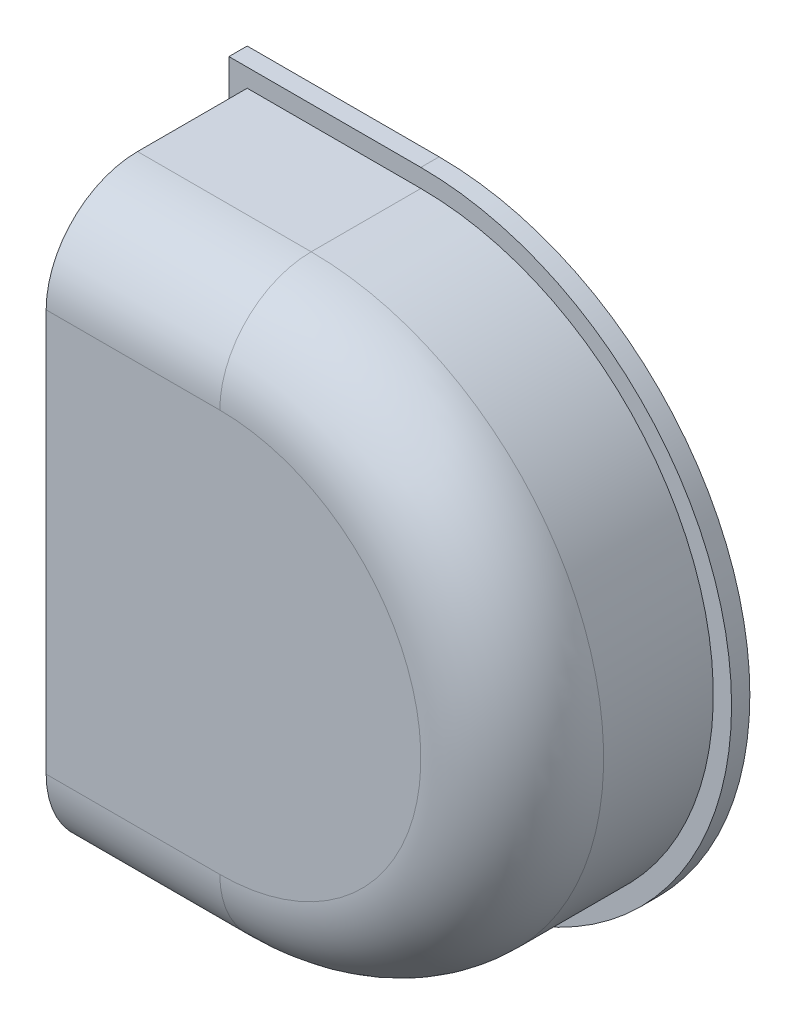
ISO-10303-21;
HEADER;
FILE_DESCRIPTION(('STEP AP214'),'2;1');
FILE_NAME('part.step','',(''),(''),'','','');
FILE_SCHEMA(('AUTOMOTIVE_DESIGN { 1 0 10303 214 1 1 1 1 }'));
ENDSEC;
DATA;
#1=APPLICATION_CONTEXT('core data for automotive mechanical design processes');
#2=APPLICATION_PROTOCOL_DEFINITION('international standard','automotive_design',2000,#1);
#3=PRODUCT_CONTEXT('',#1,'mechanical');
#4=PRODUCT('Part','Part','',(#3));
#5=PRODUCT_RELATED_PRODUCT_CATEGORY('part','',(#4));
#6=PRODUCT_DEFINITION_FORMATION('','',#4);
#7=PRODUCT_DEFINITION_CONTEXT('part definition',#1,'design');
#8=PRODUCT_DEFINITION('design','',#6,#7);
#9=PRODUCT_DEFINITION_SHAPE('','',#8);
#10=(LENGTH_UNIT() NAMED_UNIT(*) SI_UNIT(.MILLI.,.METRE.));
#11=(NAMED_UNIT(*) PLANE_ANGLE_UNIT() SI_UNIT($,.RADIAN.));
#12=(NAMED_UNIT(*) SI_UNIT($,.STERADIAN.) SOLID_ANGLE_UNIT());
#13=UNCERTAINTY_MEASURE_WITH_UNIT(LENGTH_MEASURE(1.E-05),#10,'distance_accuracy_value','');
#14=(GEOMETRIC_REPRESENTATION_CONTEXT(3) GLOBAL_UNCERTAINTY_ASSIGNED_CONTEXT((#13)) GLOBAL_UNIT_ASSIGNED_CONTEXT((#10,
#11,#12)) REPRESENTATION_CONTEXT('',''));
#15=CARTESIAN_POINT('',(0.,0.,0.));
#16=DIRECTION('',(0.,0.,1.));
#17=DIRECTION('',(1.,0.,0.));
#18=AXIS2_PLACEMENT_3D('',#15,#16,#17);
#19=CARTESIAN_POINT('',(19.,0.,22.));
#20=DIRECTION('',(0.,1.,0.));
#21=DIRECTION('',(0.,0.,1.));
#22=AXIS2_PLACEMENT_3D('',#19,#20,#21);
#23=PLANE('',#22);
#24=DIRECTION('',(0.,0.,-1.));
#25=VECTOR('',#24,1.);
#26=CARTESIAN_POINT('',(19.,0.,22.));
#27=LINE('',#26,#25);
#28=CARTESIAN_POINT('',(19.,0.,12.));
#29=VERTEX_POINT('',#28);
#30=CARTESIAN_POINT('',(19.,0.,0.));
#31=VERTEX_POINT('',#30);
#32=EDGE_CURVE('E264',#29,#31,#27,.T.);
#33=ORIENTED_EDGE('',*,*,#32,.F.);
#34=DIRECTION('',(1.,0.,0.));
#35=VECTOR('',#34,1.);
#36=CARTESIAN_POINT('',(19.,0.,12.));
#37=LINE('',#36,#35);
#38=CARTESIAN_POINT('',(0.,0.,12.));
#39=VERTEX_POINT('',#38);
#40=EDGE_CURVE('E274',#29,#39,#37,.F.);
#41=ORIENTED_EDGE('',*,*,#40,.T.);
#42=DIRECTION('',(0.,0.,-1.));
#43=VECTOR('',#42,1.);
#44=CARTESIAN_POINT('',(0.,0.,22.));
#45=LINE('',#44,#43);
#46=CARTESIAN_POINT('',(0.,0.,0.));
#47=VERTEX_POINT('',#46);
#48=EDGE_CURVE('E245',#39,#47,#45,.T.);
#49=ORIENTED_EDGE('',*,*,#48,.T.);
#50=DIRECTION('',(1.,0.,0.));
#51=VECTOR('',#50,1.);
#52=CARTESIAN_POINT('',(19.,0.,0.));
#53=LINE('',#52,#51);
#54=EDGE_CURVE('E247',#47,#31,#53,.T.);
#55=ORIENTED_EDGE('',*,*,#54,.T.);
#56=EDGE_LOOP('',(#33,#41,#49,#55));
#57=FACE_BOUND('',#56,.T.);
#58=ADVANCED_FACE('F35',(#57),#23,.F.);
#59=CARTESIAN_POINT('',(19.,32.,22.));
#60=DIRECTION('',(0.,0.,-1.));
#61=DIRECTION('',(-1.,0.,0.));
#62=AXIS2_PLACEMENT_3D('',#59,#60,#61);
#63=CYLINDRICAL_SURFACE('',#62,32.);
#64=DIRECTION('',(0.,0.,-1.));
#65=VECTOR('',#64,1.);
#66=CARTESIAN_POINT('',(19.,64.,22.));
#67=LINE('',#66,#65);
#68=CARTESIAN_POINT('',(19.,64.,12.));
#69=VERTEX_POINT('',#68);
#70=CARTESIAN_POINT('',(19.,64.,0.));
#71=VERTEX_POINT('',#70);
#72=EDGE_CURVE('E262',#69,#71,#67,.T.);
#73=ORIENTED_EDGE('',*,*,#72,.F.);
#74=CARTESIAN_POINT('',(19.,32.,12.));
#75=DIRECTION('',(0.,0.,-1.));
#76=DIRECTION('',(-1.,0.,0.));
#77=AXIS2_PLACEMENT_3D('',#74,#75,#76);
#78=CIRCLE('',#77,32.);
#79=EDGE_CURVE('E44',#69,#29,#78,.T.);
#80=ORIENTED_EDGE('',*,*,#79,.T.);
#81=ORIENTED_EDGE('',*,*,#32,.T.);
#82=CARTESIAN_POINT('',(19.,32.,0.));
#83=DIRECTION('',(0.,0.,1.));
#84=DIRECTION('',(-1.,0.,0.));
#85=AXIS2_PLACEMENT_3D('',#82,#83,#84);
#86=CIRCLE('',#85,32.);
#87=EDGE_CURVE('E250',#31,#71,#86,.T.);
#88=ORIENTED_EDGE('',*,*,#87,.T.);
#89=EDGE_LOOP('',(#73,#80,#81,#88));
#90=FACE_BOUND('',#89,.T.);
#91=ADVANCED_FACE('F300',(#90),#63,.T.);
#92=CARTESIAN_POINT('',(0.,64.,22.));
#93=DIRECTION('',(0.,-1.,0.));
#94=DIRECTION('',(0.,0.,-1.));
#95=AXIS2_PLACEMENT_3D('',#92,#93,#94);
#96=PLANE('',#95);
#97=DIRECTION('',(0.,0.,-1.));
#98=VECTOR('',#97,1.);
#99=CARTESIAN_POINT('',(0.,64.,22.));
#100=LINE('',#99,#98);
#101=CARTESIAN_POINT('',(0.,64.,12.));
#102=VERTEX_POINT('',#101);
#103=CARTESIAN_POINT('',(0.,64.,0.));
#104=VERTEX_POINT('',#103);
#105=EDGE_CURVE('E260',#102,#104,#100,.T.);
#106=ORIENTED_EDGE('',*,*,#105,.F.);
#107=DIRECTION('',(-1.,0.,0.));
#108=VECTOR('',#107,1.);
#109=CARTESIAN_POINT('',(0.,64.,12.));
#110=LINE('',#109,#108);
#111=EDGE_CURVE('E12',#102,#69,#110,.F.);
#112=ORIENTED_EDGE('',*,*,#111,.T.);
#113=ORIENTED_EDGE('',*,*,#72,.T.);
#114=DIRECTION('',(-1.,0.,0.));
#115=VECTOR('',#114,1.);
#116=CARTESIAN_POINT('',(0.,64.,0.));
#117=LINE('',#116,#115);
#118=EDGE_CURVE('E253',#71,#104,#117,.T.);
#119=ORIENTED_EDGE('',*,*,#118,.T.);
#120=EDGE_LOOP('',(#106,#112,#113,#119));
#121=FACE_BOUND('',#120,.T.);
#122=ADVANCED_FACE('F301',(#121),#96,.F.);
#123=CARTESIAN_POINT('',(0.,0.,22.));
#124=DIRECTION('',(1.,0.,0.));
#125=DIRECTION('',(0.,0.,-1.));
#126=AXIS2_PLACEMENT_3D('',#123,#124,#125);
#127=PLANE('',#126);
#128=ORIENTED_EDGE('',*,*,#48,.F.);
#129=CARTESIAN_POINT('',(0.,10.,12.));
#130=DIRECTION('',(1.,0.,0.));
#131=DIRECTION('',(0.,0.,-1.));
#132=AXIS2_PLACEMENT_3D('',#129,#130,#131);
#133=CIRCLE('',#132,10.);
#134=CARTESIAN_POINT('',(0.,10.,22.));
#135=VERTEX_POINT('',#134);
#136=EDGE_CURVE('E277',#39,#135,#133,.F.);
#137=ORIENTED_EDGE('',*,*,#136,.T.);
#138=DIRECTION('',(0.,-1.,0.));
#139=VECTOR('',#138,1.);
#140=CARTESIAN_POINT('',(0.,0.,22.));
#141=LINE('',#140,#139);
#142=CARTESIAN_POINT('',(0.,54.,22.));
#143=VERTEX_POINT('',#142);
#144=EDGE_CURVE('E242',#143,#135,#141,.T.);
#145=ORIENTED_EDGE('',*,*,#144,.F.);
#146=CARTESIAN_POINT('',(0.,54.,12.));
#147=DIRECTION('',(1.,0.,0.));
#148=DIRECTION('',(0.,0.,-1.));
#149=AXIS2_PLACEMENT_3D('',#146,#147,#148);
#150=CIRCLE('',#149,10.);
#151=EDGE_CURVE('E58',#143,#102,#150,.F.);
#152=ORIENTED_EDGE('',*,*,#151,.T.);
#153=ORIENTED_EDGE('',*,*,#105,.T.);
#154=DIRECTION('',(0.,-1.,0.));
#155=VECTOR('',#154,1.);
#156=CARTESIAN_POINT('',(0.,0.,0.));
#157=LINE('',#156,#155);
#158=EDGE_CURVE('E246',#104,#47,#157,.T.);
#159=ORIENTED_EDGE('',*,*,#158,.T.);
#160=EDGE_LOOP('',(#128,#137,#145,#152,#153,#159));
#161=FACE_BOUND('',#160,.T.);
#162=ADVANCED_FACE('F294',(#161),#127,.F.);
#163=CARTESIAN_POINT('',(19.,32.,22.));
#164=DIRECTION('',(0.,0.,-1.));
#165=DIRECTION('',(-1.,0.,0.));
#166=AXIS2_PLACEMENT_3D('',#163,#164,#165);
#167=PLANE('',#166);
#168=ORIENTED_EDGE('',*,*,#144,.T.);
#169=DIRECTION('',(1.,0.,0.));
#170=VECTOR('',#169,1.);
#171=CARTESIAN_POINT('',(19.,10.,22.));
#172=LINE('',#171,#170);
#173=CARTESIAN_POINT('',(19.,10.,22.));
#174=VERTEX_POINT('',#173);
#175=EDGE_CURVE('E271',#135,#174,#172,.T.);
#176=ORIENTED_EDGE('',*,*,#175,.T.);
#177=CARTESIAN_POINT('',(19.,32.,22.));
#178=DIRECTION('',(0.,0.,-1.));
#179=DIRECTION('',(-1.,0.,0.));
#180=AXIS2_PLACEMENT_3D('',#177,#178,#179);
#181=CIRCLE('',#180,22.);
#182=CARTESIAN_POINT('',(19.,54.,22.));
#183=VERTEX_POINT('',#182);
#184=EDGE_CURVE('E269',#174,#183,#181,.F.);
#185=ORIENTED_EDGE('',*,*,#184,.T.);
#186=DIRECTION('',(-1.,0.,0.));
#187=VECTOR('',#186,1.);
#188=CARTESIAN_POINT('',(19.,54.,22.));
#189=LINE('',#188,#187);
#190=EDGE_CURVE('E267',#183,#143,#189,.T.);
#191=ORIENTED_EDGE('',*,*,#190,.T.);
#192=EDGE_LOOP('',(#168,#176,#185,#191));
#193=FACE_BOUND('',#192,.T.);
#194=ADVANCED_FACE('F292',(#193),#167,.F.);
#195=CARTESIAN_POINT('',(19.,54.,12.));
#196=DIRECTION('',(-1.,0.,0.));
#197=DIRECTION('',(0.,0.,1.));
#198=AXIS2_PLACEMENT_3D('',#195,#196,#197);
#199=CYLINDRICAL_SURFACE('',#198,10.);
#200=ORIENTED_EDGE('',*,*,#151,.F.);
#201=ORIENTED_EDGE('',*,*,#190,.F.);
#202=CARTESIAN_POINT('',(19.,54.,12.));
#203=DIRECTION('',(1.,0.,0.));
#204=DIRECTION('',(0.,0.,-1.));
#205=AXIS2_PLACEMENT_3D('',#202,#203,#204);
#206=CIRCLE('',#205,10.);
#207=EDGE_CURVE('E39',#69,#183,#206,.T.);
#208=ORIENTED_EDGE('',*,*,#207,.F.);
#209=ORIENTED_EDGE('',*,*,#111,.F.);
#210=EDGE_LOOP('',(#200,#201,#208,#209));
#211=FACE_BOUND('',#210,.T.);
#212=ADVANCED_FACE('F37',(#211),#199,.T.);
#213=CARTESIAN_POINT('',(19.,32.,12.));
#214=DIRECTION('',(0.,0.,-1.));
#215=DIRECTION('',(-1.,0.,0.));
#216=AXIS2_PLACEMENT_3D('',#213,#214,#215);
#217=TOROIDAL_SURFACE('',#216,22.,10.);
#218=ORIENTED_EDGE('',*,*,#207,.T.);
#219=ORIENTED_EDGE('',*,*,#184,.F.);
#220=CARTESIAN_POINT('',(19.,10.,12.));
#221=DIRECTION('',(-1.,0.,0.));
#222=DIRECTION('',(0.,0.,1.));
#223=AXIS2_PLACEMENT_3D('',#220,#221,#222);
#224=CIRCLE('',#223,10.);
#225=EDGE_CURVE('E229',#29,#174,#224,.T.);
#226=ORIENTED_EDGE('',*,*,#225,.F.);
#227=ORIENTED_EDGE('',*,*,#79,.F.);
#228=EDGE_LOOP('',(#218,#219,#226,#227));
#229=FACE_BOUND('',#228,.T.);
#230=ADVANCED_FACE('F288',(#229),#217,.T.);
#231=CARTESIAN_POINT('',(19.,10.,12.));
#232=DIRECTION('',(1.,0.,0.));
#233=DIRECTION('',(0.,0.,-1.));
#234=AXIS2_PLACEMENT_3D('',#231,#232,#233);
#235=CYLINDRICAL_SURFACE('',#234,10.);
#236=ORIENTED_EDGE('',*,*,#136,.F.);
#237=ORIENTED_EDGE('',*,*,#40,.F.);
#238=ORIENTED_EDGE('',*,*,#225,.T.);
#239=ORIENTED_EDGE('',*,*,#175,.F.);
#240=EDGE_LOOP('',(#236,#237,#238,#239));
#241=FACE_BOUND('',#240,.T.);
#242=ADVANCED_FACE('F296',(#241),#235,.T.);
#243=CARTESIAN_POINT('',(19.,32.,0.));
#244=DIRECTION('',(0.,0.,-1.));
#245=DIRECTION('',(-1.,0.,0.));
#246=AXIS2_PLACEMENT_3D('',#243,#244,#245);
#247=PLANE('',#246);
#248=DIRECTION('',(-1.,0.,0.));
#249=VECTOR('',#248,1.);
#250=CARTESIAN_POINT('',(19.,-2.,0.));
#251=LINE('',#250,#249);
#252=CARTESIAN_POINT('',(19.,-2.,0.));
#253=VERTEX_POINT('',#252);
#254=CARTESIAN_POINT('',(-2.,-2.,0.));
#255=VERTEX_POINT('',#254);
#256=EDGE_CURVE('E185',#253,#255,#251,.T.);
#257=ORIENTED_EDGE('',*,*,#256,.F.);
#258=CARTESIAN_POINT('',(19.,32.,0.));
#259=DIRECTION('',(0.,0.,-1.));
#260=DIRECTION('',(-1.,0.,0.));
#261=AXIS2_PLACEMENT_3D('',#258,#259,#260);
#262=CIRCLE('',#261,34.);
#263=CARTESIAN_POINT('',(19.,66.,0.));
#264=VERTEX_POINT('',#263);
#265=EDGE_CURVE('E190',#264,#253,#262,.T.);
#266=ORIENTED_EDGE('',*,*,#265,.F.);
#267=DIRECTION('',(1.,0.,0.));
#268=VECTOR('',#267,1.);
#269=CARTESIAN_POINT('',(-2.,66.,0.));
#270=LINE('',#269,#268);
#271=CARTESIAN_POINT('',(-2.,66.,0.));
#272=VERTEX_POINT('',#271);
#273=EDGE_CURVE('E201',#272,#264,#270,.T.);
#274=ORIENTED_EDGE('',*,*,#273,.F.);
#275=DIRECTION('',(0.,1.,0.));
#276=VECTOR('',#275,1.);
#277=CARTESIAN_POINT('',(-2.,-2.,0.));
#278=LINE('',#277,#276);
#279=EDGE_CURVE('E199',#255,#272,#278,.T.);
#280=ORIENTED_EDGE('',*,*,#279,.F.);
#281=EDGE_LOOP('',(#257,#266,#274,#280));
#282=FACE_BOUND('',#281,.T.);
#283=ORIENTED_EDGE('',*,*,#87,.F.);
#284=ORIENTED_EDGE('',*,*,#54,.F.);
#285=ORIENTED_EDGE('',*,*,#158,.F.);
#286=ORIENTED_EDGE('',*,*,#118,.F.);
#287=EDGE_LOOP('',(#283,#284,#285,#286));
#288=FACE_BOUND('',#287,.T.);
#289=ADVANCED_FACE('F303',(#282,#288),#247,.F.);
#290=CARTESIAN_POINT('',(19.,32.,-2.));
#291=DIRECTION('',(0.,0.,-1.));
#292=DIRECTION('',(-1.,0.,0.));
#293=AXIS2_PLACEMENT_3D('',#290,#291,#292);
#294=PLANE('',#293);
#295=DIRECTION('',(-1.,0.,0.));
#296=VECTOR('',#295,1.);
#297=CARTESIAN_POINT('',(19.,-2.,-2.));
#298=LINE('',#297,#296);
#299=CARTESIAN_POINT('',(19.,-2.,-2.));
#300=VERTEX_POINT('',#299);
#301=CARTESIAN_POINT('',(-2.,-2.,-2.));
#302=VERTEX_POINT('',#301);
#303=EDGE_CURVE('E186',#300,#302,#298,.T.);
#304=ORIENTED_EDGE('',*,*,#303,.T.);
#305=DIRECTION('',(0.,1.,0.));
#306=VECTOR('',#305,1.);
#307=CARTESIAN_POINT('',(-2.,-2.,-2.));
#308=LINE('',#307,#306);
#309=CARTESIAN_POINT('',(-2.,66.,-2.));
#310=VERTEX_POINT('',#309);
#311=EDGE_CURVE('E189',#302,#310,#308,.T.);
#312=ORIENTED_EDGE('',*,*,#311,.T.);
#313=DIRECTION('',(1.,0.,0.));
#314=VECTOR('',#313,1.);
#315=CARTESIAN_POINT('',(-2.,66.,-2.));
#316=LINE('',#315,#314);
#317=CARTESIAN_POINT('',(19.,66.,-2.));
#318=VERTEX_POINT('',#317);
#319=EDGE_CURVE('E192',#310,#318,#316,.T.);
#320=ORIENTED_EDGE('',*,*,#319,.T.);
#321=CARTESIAN_POINT('',(19.,32.,-2.));
#322=DIRECTION('',(0.,0.,-1.));
#323=DIRECTION('',(-1.,0.,0.));
#324=AXIS2_PLACEMENT_3D('',#321,#322,#323);
#325=CIRCLE('',#324,34.);
#326=EDGE_CURVE('E194',#318,#300,#325,.T.);
#327=ORIENTED_EDGE('',*,*,#326,.T.);
#328=EDGE_LOOP('',(#304,#312,#320,#327));
#329=FACE_BOUND('',#328,.T.);
#330=DIRECTION('',(0.,1.,0.));
#331=VECTOR('',#330,1.);
#332=CARTESIAN_POINT('',(3.,3.,-2.));
#333=LINE('',#332,#331);
#334=CARTESIAN_POINT('',(3.,3.,-2.));
#335=VERTEX_POINT('',#334);
#336=CARTESIAN_POINT('',(3.,61.,-2.));
#337=VERTEX_POINT('',#336);
#338=EDGE_CURVE('E157',#335,#337,#333,.T.);
#339=ORIENTED_EDGE('',*,*,#338,.F.);
#340=DIRECTION('',(-1.,0.,0.));
#341=VECTOR('',#340,1.);
#342=CARTESIAN_POINT('',(19.,3.,-2.));
#343=LINE('',#342,#341);
#344=CARTESIAN_POINT('',(19.,3.,-2.));
#345=VERTEX_POINT('',#344);
#346=EDGE_CURVE('E167',#345,#335,#343,.T.);
#347=ORIENTED_EDGE('',*,*,#346,.F.);
#348=CARTESIAN_POINT('',(19.,32.,-2.));
#349=DIRECTION('',(0.,0.,-1.));
#350=DIRECTION('',(-1.,0.,0.));
#351=AXIS2_PLACEMENT_3D('',#348,#349,#350);
#352=CIRCLE('',#351,29.);
#353=CARTESIAN_POINT('',(19.,61.,-2.));
#354=VERTEX_POINT('',#353);
#355=EDGE_CURVE('E180',#354,#345,#352,.T.);
#356=ORIENTED_EDGE('',*,*,#355,.F.);
#357=DIRECTION('',(1.,0.,0.));
#358=VECTOR('',#357,1.);
#359=CARTESIAN_POINT('',(3.,61.,-2.));
#360=LINE('',#359,#358);
#361=EDGE_CURVE('E178',#337,#354,#360,.T.);
#362=ORIENTED_EDGE('',*,*,#361,.F.);
#363=EDGE_LOOP('',(#339,#347,#356,#362));
#364=FACE_BOUND('',#363,.T.);
#365=ADVANCED_FACE('F176',(#329,#364),#294,.T.);
#366=CARTESIAN_POINT('',(19.,-2.,-2.));
#367=DIRECTION('',(0.,1.,0.));
#368=DIRECTION('',(-1.,0.,0.));
#369=AXIS2_PLACEMENT_3D('',#366,#367,#368);
#370=PLANE('',#369);
#371=ORIENTED_EDGE('',*,*,#256,.T.);
#372=DIRECTION('',(0.,0.,1.));
#373=VECTOR('',#372,1.);
#374=CARTESIAN_POINT('',(-2.,-2.,-2.));
#375=LINE('',#374,#373);
#376=EDGE_CURVE('E212',#302,#255,#375,.T.);
#377=ORIENTED_EDGE('',*,*,#376,.F.);
#378=ORIENTED_EDGE('',*,*,#303,.F.);
#379=DIRECTION('',(0.,0.,1.));
#380=VECTOR('',#379,1.);
#381=CARTESIAN_POINT('',(19.,-2.,-2.));
#382=LINE('',#381,#380);
#383=EDGE_CURVE('E196',#300,#253,#382,.T.);
#384=ORIENTED_EDGE('',*,*,#383,.T.);
#385=EDGE_LOOP('',(#371,#377,#378,#384));
#386=FACE_BOUND('',#385,.T.);
#387=ADVANCED_FACE('F311',(#386),#370,.F.);
#388=CARTESIAN_POINT('',(-2.,-2.,-2.));
#389=DIRECTION('',(1.,0.,0.));
#390=DIRECTION('',(0.,0.,-1.));
#391=AXIS2_PLACEMENT_3D('',#388,#389,#390);
#392=PLANE('',#391);
#393=ORIENTED_EDGE('',*,*,#279,.T.);
#394=DIRECTION('',(0.,0.,1.));
#395=VECTOR('',#394,1.);
#396=CARTESIAN_POINT('',(-2.,66.,-2.));
#397=LINE('',#396,#395);
#398=EDGE_CURVE('E209',#310,#272,#397,.T.);
#399=ORIENTED_EDGE('',*,*,#398,.F.);
#400=ORIENTED_EDGE('',*,*,#311,.F.);
#401=ORIENTED_EDGE('',*,*,#376,.T.);
#402=EDGE_LOOP('',(#393,#399,#400,#401));
#403=FACE_BOUND('',#402,.T.);
#404=ADVANCED_FACE('F369',(#403),#392,.F.);
#405=CARTESIAN_POINT('',(-2.,66.,-2.));
#406=DIRECTION('',(0.,-1.,0.));
#407=DIRECTION('',(0.,0.,-1.));
#408=AXIS2_PLACEMENT_3D('',#405,#406,#407);
#409=PLANE('',#408);
#410=ORIENTED_EDGE('',*,*,#273,.T.);
#411=DIRECTION('',(0.,0.,1.));
#412=VECTOR('',#411,1.);
#413=CARTESIAN_POINT('',(19.,66.,-2.));
#414=LINE('',#413,#412);
#415=EDGE_CURVE('E206',#318,#264,#414,.T.);
#416=ORIENTED_EDGE('',*,*,#415,.F.);
#417=ORIENTED_EDGE('',*,*,#319,.F.);
#418=ORIENTED_EDGE('',*,*,#398,.T.);
#419=EDGE_LOOP('',(#410,#416,#417,#418));
#420=FACE_BOUND('',#419,.T.);
#421=ADVANCED_FACE('F379',(#420),#409,.F.);
#422=CARTESIAN_POINT('',(19.,32.,-2.));
#423=DIRECTION('',(0.,0.,1.));
#424=DIRECTION('',(1.,0.,0.));
#425=AXIS2_PLACEMENT_3D('',#422,#423,#424);
#426=CYLINDRICAL_SURFACE('',#425,34.);
#427=ORIENTED_EDGE('',*,*,#265,.T.);
#428=ORIENTED_EDGE('',*,*,#383,.F.);
#429=ORIENTED_EDGE('',*,*,#326,.F.);
#430=ORIENTED_EDGE('',*,*,#415,.T.);
#431=EDGE_LOOP('',(#427,#428,#429,#430));
#432=FACE_BOUND('',#431,.T.);
#433=ADVANCED_FACE('F389',(#432),#426,.T.);
#434=CARTESIAN_POINT('',(19.,32.,12.));
#435=DIRECTION('',(0.,0.,-1.));
#436=DIRECTION('',(-1.,0.,0.));
#437=AXIS2_PLACEMENT_3D('',#434,#435,#436);
#438=TOROIDAL_SURFACE('',#437,22.,7.);
#439=CARTESIAN_POINT('',(19.,54.,12.));
#440=DIRECTION('',(-1.,0.,0.));
#441=DIRECTION('',(0.,-1.,0.));
#442=AXIS2_PLACEMENT_3D('',#439,#440,#441);
#443=CIRCLE('',#442,7.);
#444=CARTESIAN_POINT('',(19.,61.,12.));
#445=VERTEX_POINT('',#444);
#446=CARTESIAN_POINT('',(19.,54.,19.));
#447=VERTEX_POINT('',#446);
#448=EDGE_CURVE('E232',#445,#447,#443,.F.);
#449=ORIENTED_EDGE('',*,*,#448,.F.);
#450=CARTESIAN_POINT('',(19.,32.,12.));
#451=DIRECTION('',(0.,0.,-1.));
#452=DIRECTION('',(-1.,0.,0.));
#453=AXIS2_PLACEMENT_3D('',#450,#451,#452);
#454=CIRCLE('',#453,29.);
#455=CARTESIAN_POINT('',(19.,3.,12.));
#456=VERTEX_POINT('',#455);
#457=EDGE_CURVE('E224',#445,#456,#454,.T.);
#458=ORIENTED_EDGE('',*,*,#457,.T.);
#459=CARTESIAN_POINT('',(19.,10.,12.));
#460=DIRECTION('',(1.,0.,0.));
#461=DIRECTION('',(0.,0.,-1.));
#462=AXIS2_PLACEMENT_3D('',#459,#460,#461);
#463=CIRCLE('',#462,7.);
#464=CARTESIAN_POINT('',(19.,10.,19.));
#465=VERTEX_POINT('',#464);
#466=EDGE_CURVE('E215',#456,#465,#463,.F.);
#467=ORIENTED_EDGE('',*,*,#466,.T.);
#468=CARTESIAN_POINT('',(19.,32.,19.));
#469=DIRECTION('',(0.,0.,-1.));
#470=DIRECTION('',(-1.,0.,0.));
#471=AXIS2_PLACEMENT_3D('',#468,#469,#470);
#472=CIRCLE('',#471,22.);
#473=EDGE_CURVE('E236',#465,#447,#472,.F.);
#474=ORIENTED_EDGE('',*,*,#473,.T.);
#475=EDGE_LOOP('',(#449,#458,#467,#474));
#476=FACE_BOUND('',#475,.T.);
#477=ADVANCED_FACE('F399',(#476),#438,.F.);
#478=CARTESIAN_POINT('',(19.,10.,12.));
#479=DIRECTION('',(1.,0.,0.));
#480=DIRECTION('',(0.,0.,-1.));
#481=AXIS2_PLACEMENT_3D('',#478,#479,#480);
#482=CYLINDRICAL_SURFACE('',#481,7.);
#483=CARTESIAN_POINT('',(3.,10.,12.));
#484=DIRECTION('',(1.,0.,0.));
#485=DIRECTION('',(0.,0.,-1.));
#486=AXIS2_PLACEMENT_3D('',#483,#484,#485);
#487=CIRCLE('',#486,7.);
#488=CARTESIAN_POINT('',(3.,3.,12.));
#489=VERTEX_POINT('',#488);
#490=CARTESIAN_POINT('',(3.,10.,19.));
#491=VERTEX_POINT('',#490);
#492=EDGE_CURVE('E160',#489,#491,#487,.F.);
#493=ORIENTED_EDGE('',*,*,#492,.T.);
#494=DIRECTION('',(-1.,0.,0.));
#495=VECTOR('',#494,1.);
#496=CARTESIAN_POINT('',(19.,10.,19.));
#497=LINE('',#496,#495);
#498=EDGE_CURVE('E221',#491,#465,#497,.F.);
#499=ORIENTED_EDGE('',*,*,#498,.T.);
#500=ORIENTED_EDGE('',*,*,#466,.F.);
#501=DIRECTION('',(1.,0.,0.));
#502=VECTOR('',#501,1.);
#503=CARTESIAN_POINT('',(19.,3.,12.));
#504=LINE('',#503,#502);
#505=EDGE_CURVE('E219',#456,#489,#504,.F.);
#506=ORIENTED_EDGE('',*,*,#505,.T.);
#507=EDGE_LOOP('',(#493,#499,#500,#506));
#508=FACE_BOUND('',#507,.T.);
#509=ADVANCED_FACE('F337',(#508),#482,.F.);
#510=CARTESIAN_POINT('',(19.,32.,19.));
#511=DIRECTION('',(0.,0.,-1.));
#512=DIRECTION('',(-1.,0.,0.));
#513=AXIS2_PLACEMENT_3D('',#510,#511,#512);
#514=PLANE('',#513);
#515=CARTESIAN_POINT('',(18.9999999999999,32.,19.));
#516=DIRECTION('',(0.,0.,-1.));
#517=DIRECTION('',(-1.,0.,0.));
#518=AXIS2_PLACEMENT_3D('',#515,#516,#517);
#519=CIRCLE('',#518,5.);
#520=CARTESIAN_POINT('',(13.9999999999999,32.,19.));
#521=VERTEX_POINT('',#520);
#522=EDGE_CURVE('E481',#521,#521,#519,.T.);
#523=ORIENTED_EDGE('',*,*,#522,.F.);
#524=EDGE_LOOP('',(#523));
#525=FACE_BOUND('',#524,.T.);
#526=DIRECTION('',(0.,-1.,0.));
#527=VECTOR('',#526,1.);
#528=CARTESIAN_POINT('',(3.,32.,19.));
#529=LINE('',#528,#527);
#530=CARTESIAN_POINT('',(3.,54.,19.));
#531=VERTEX_POINT('',#530);
#532=EDGE_CURVE('E164',#531,#491,#529,.T.);
#533=ORIENTED_EDGE('',*,*,#532,.F.);
#534=DIRECTION('',(-1.,0.,0.));
#535=VECTOR('',#534,1.);
#536=CARTESIAN_POINT('',(19.,54.,19.));
#537=LINE('',#536,#535);
#538=EDGE_CURVE('E217',#447,#531,#537,.T.);
#539=ORIENTED_EDGE('',*,*,#538,.F.);
#540=ORIENTED_EDGE('',*,*,#473,.F.);
#541=ORIENTED_EDGE('',*,*,#498,.F.);
#542=EDGE_LOOP('',(#533,#539,#540,#541));
#543=FACE_BOUND('',#542,.T.);
#544=ADVANCED_FACE('F450',(#525,#543),#514,.T.);
#545=CARTESIAN_POINT('',(19.,54.,12.));
#546=DIRECTION('',(-1.,0.,0.));
#547=DIRECTION('',(0.,0.,1.));
#548=AXIS2_PLACEMENT_3D('',#545,#546,#547);
#549=CYLINDRICAL_SURFACE('',#548,7.);
#550=CARTESIAN_POINT('',(3.,54.,12.));
#551=DIRECTION('',(1.,0.,0.));
#552=DIRECTION('',(0.,0.,-1.));
#553=AXIS2_PLACEMENT_3D('',#550,#551,#552);
#554=CIRCLE('',#553,7.);
#555=CARTESIAN_POINT('',(3.,61.,12.));
#556=VERTEX_POINT('',#555);
#557=EDGE_CURVE('E220',#531,#556,#554,.F.);
#558=ORIENTED_EDGE('',*,*,#557,.T.);
#559=DIRECTION('',(1.,0.,0.));
#560=VECTOR('',#559,1.);
#561=CARTESIAN_POINT('',(0.,61.,12.));
#562=LINE('',#561,#560);
#563=EDGE_CURVE('E226',#556,#445,#562,.T.);
#564=ORIENTED_EDGE('',*,*,#563,.T.);
#565=ORIENTED_EDGE('',*,*,#448,.T.);
#566=ORIENTED_EDGE('',*,*,#538,.T.);
#567=EDGE_LOOP('',(#558,#564,#565,#566));
#568=FACE_BOUND('',#567,.T.);
#569=ADVANCED_FACE('F410',(#568),#549,.F.);
#570=CARTESIAN_POINT('',(3.,0.,22.));
#571=DIRECTION('',(1.,0.,0.));
#572=DIRECTION('',(0.,0.,-1.));
#573=AXIS2_PLACEMENT_3D('',#570,#571,#572);
#574=PLANE('',#573);
#575=DIRECTION('',(0.,0.,-1.));
#576=VECTOR('',#575,1.);
#577=CARTESIAN_POINT('',(3.,3.,22.));
#578=LINE('',#577,#576);
#579=EDGE_CURVE('E152',#489,#335,#578,.T.);
#580=ORIENTED_EDGE('',*,*,#579,.T.);
#581=ORIENTED_EDGE('',*,*,#338,.T.);
#582=DIRECTION('',(0.,0.,-1.));
#583=VECTOR('',#582,1.);
#584=CARTESIAN_POINT('',(3.,61.,22.));
#585=LINE('',#584,#583);
#586=EDGE_CURVE('E163',#556,#337,#585,.T.);
#587=ORIENTED_EDGE('',*,*,#586,.F.);
#588=ORIENTED_EDGE('',*,*,#557,.F.);
#589=ORIENTED_EDGE('',*,*,#532,.T.);
#590=ORIENTED_EDGE('',*,*,#492,.F.);
#591=EDGE_LOOP('',(#580,#581,#587,#588,#589,#590));
#592=FACE_BOUND('',#591,.T.);
#593=ADVANCED_FACE('F154',(#592),#574,.T.);
#594=CARTESIAN_POINT('',(0.,61.,22.));
#595=DIRECTION('',(0.,-1.,0.));
#596=DIRECTION('',(0.,0.,-1.));
#597=AXIS2_PLACEMENT_3D('',#594,#595,#596);
#598=PLANE('',#597);
#599=ORIENTED_EDGE('',*,*,#586,.T.);
#600=ORIENTED_EDGE('',*,*,#361,.T.);
#601=DIRECTION('',(0.,0.,-1.));
#602=VECTOR('',#601,1.);
#603=CARTESIAN_POINT('',(19.,61.,22.));
#604=LINE('',#603,#602);
#605=EDGE_CURVE('E218',#445,#354,#604,.T.);
#606=ORIENTED_EDGE('',*,*,#605,.F.);
#607=ORIENTED_EDGE('',*,*,#563,.F.);
#608=EDGE_LOOP('',(#599,#600,#606,#607));
#609=FACE_BOUND('',#608,.T.);
#610=ADVANCED_FACE('F409',(#609),#598,.T.);
#611=CARTESIAN_POINT('',(19.,32.,22.));
#612=DIRECTION('',(0.,0.,-1.));
#613=DIRECTION('',(-1.,0.,0.));
#614=AXIS2_PLACEMENT_3D('',#611,#612,#613);
#615=CYLINDRICAL_SURFACE('',#614,29.);
#616=ORIENTED_EDGE('',*,*,#605,.T.);
#617=ORIENTED_EDGE('',*,*,#355,.T.);
#618=DIRECTION('',(0.,0.,-1.));
#619=VECTOR('',#618,1.);
#620=CARTESIAN_POINT('',(19.,3.,22.));
#621=LINE('',#620,#619);
#622=EDGE_CURVE('E170',#456,#345,#621,.T.);
#623=ORIENTED_EDGE('',*,*,#622,.F.);
#624=ORIENTED_EDGE('',*,*,#457,.F.);
#625=EDGE_LOOP('',(#616,#617,#623,#624));
#626=FACE_BOUND('',#625,.T.);
#627=ADVANCED_FACE('F421',(#626),#615,.F.);
#628=CARTESIAN_POINT('',(19.,3.,22.));
#629=DIRECTION('',(0.,1.,0.));
#630=DIRECTION('',(0.,0.,1.));
#631=AXIS2_PLACEMENT_3D('',#628,#629,#630);
#632=PLANE('',#631);
#633=ORIENTED_EDGE('',*,*,#622,.T.);
#634=ORIENTED_EDGE('',*,*,#346,.T.);
#635=ORIENTED_EDGE('',*,*,#579,.F.);
#636=ORIENTED_EDGE('',*,*,#505,.F.);
#637=EDGE_LOOP('',(#633,#634,#635,#636));
#638=FACE_BOUND('',#637,.T.);
#639=ADVANCED_FACE('F168',(#638),#632,.T.);
#640=CARTESIAN_POINT('',(18.9999999999999,32.,-16.142135623731));
#641=DIRECTION('',(0.,0.,1.));
#642=DIRECTION('',(1.,0.,0.));
#643=AXIS2_PLACEMENT_3D('',#640,#641,#642);
#644=CYLINDRICAL_SURFACE('',#643,5.);
#645=ORIENTED_EDGE('',*,*,#522,.T.);
#646=EDGE_LOOP('',(#645));
#647=FACE_BOUND('',#646,.T.);
#648=CARTESIAN_POINT('',(18.9999999999999,32.,8.));
#649=DIRECTION('',(0.,0.,-1.));
#650=DIRECTION('',(-1.,0.,0.));
#651=AXIS2_PLACEMENT_3D('',#648,#649,#650);
#652=CIRCLE('',#651,5.);
#653=CARTESIAN_POINT('',(13.9999999999999,32.,8.));
#654=VERTEX_POINT('',#653);
#655=EDGE_CURVE('E174',#654,#654,#652,.T.);
#656=ORIENTED_EDGE('',*,*,#655,.F.);
#657=EDGE_LOOP('',(#656));
#658=FACE_BOUND('',#657,.T.);
#659=ADVANCED_FACE('F442',(#647,#658),#644,.T.);
#660=CARTESIAN_POINT('',(19.,32.,8.));
#661=DIRECTION('',(0.,0.,-1.));
#662=DIRECTION('',(-1.,0.,0.));
#663=AXIS2_PLACEMENT_3D('',#660,#661,#662);
#664=PLANE('',#663);
#665=ORIENTED_EDGE('',*,*,#655,.T.);
#666=EDGE_LOOP('',(#665));
#667=FACE_BOUND('',#666,.T.);
#668=ADVANCED_FACE('F464',(#667),#664,.T.);
#669=CLOSED_SHELL('',(#58,#91,#122,#162,#194,#212,#230,#242,#289,#365,#387,#404,#421,#433,#477,
#509,#544,#569,#593,#610,#627,#639,#659,#668));
#670=MANIFOLD_SOLID_BREP('B2',#669);
#671=ADVANCED_BREP_SHAPE_REPRESENTATION('',(#18,#670),#14);
#672=SHAPE_DEFINITION_REPRESENTATION(#9,#671);
ENDSEC;
END-ISO-10303-21;
